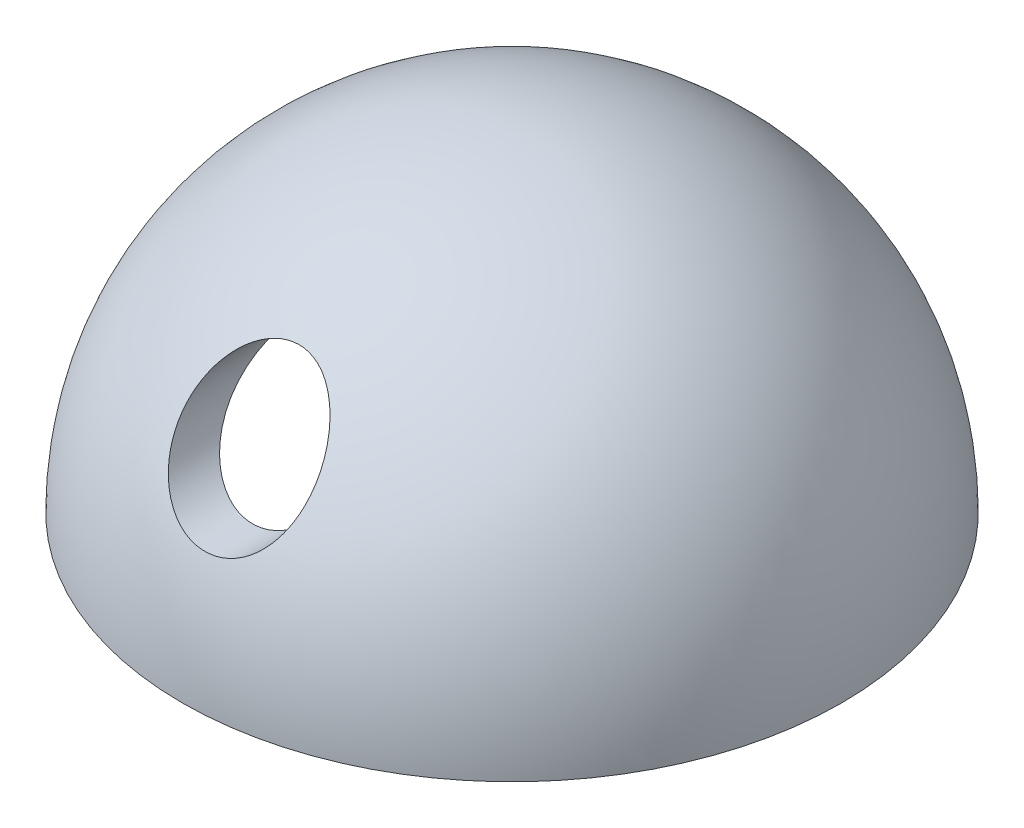
ISO-10303-21;
HEADER;
FILE_DESCRIPTION(('STEP AP214'),'2;1');
FILE_NAME('part.step','',(''),(''),'','','');
FILE_SCHEMA(('AUTOMOTIVE_DESIGN { 1 0 10303 214 1 1 1 1 }'));
ENDSEC;
DATA;
#1=APPLICATION_CONTEXT('core data for automotive mechanical design processes');
#2=APPLICATION_PROTOCOL_DEFINITION('international standard','automotive_design',2000,#1);
#3=PRODUCT_CONTEXT('',#1,'mechanical');
#4=PRODUCT('Part','Part','',(#3));
#5=PRODUCT_RELATED_PRODUCT_CATEGORY('part','',(#4));
#6=PRODUCT_DEFINITION_FORMATION('','',#4);
#7=PRODUCT_DEFINITION_CONTEXT('part definition',#1,'design');
#8=PRODUCT_DEFINITION('design','',#6,#7);
#9=PRODUCT_DEFINITION_SHAPE('','',#8);
#10=(LENGTH_UNIT() NAMED_UNIT(*) SI_UNIT(.MILLI.,.METRE.));
#11=(NAMED_UNIT(*) PLANE_ANGLE_UNIT() SI_UNIT($,.RADIAN.));
#12=(NAMED_UNIT(*) SI_UNIT($,.STERADIAN.) SOLID_ANGLE_UNIT());
#13=UNCERTAINTY_MEASURE_WITH_UNIT(LENGTH_MEASURE(1.E-05),#10,'distance_accuracy_value','');
#14=(GEOMETRIC_REPRESENTATION_CONTEXT(3) GLOBAL_UNCERTAINTY_ASSIGNED_CONTEXT((#13)) GLOBAL_UNIT_ASSIGNED_CONTEXT((#10,
#11,#12)) REPRESENTATION_CONTEXT('',''));
#15=CARTESIAN_POINT('',(0.,0.,0.));
#16=DIRECTION('',(0.,0.,1.));
#17=DIRECTION('',(1.,0.,0.));
#18=AXIS2_PLACEMENT_3D('',#15,#16,#17);
#19=CARTESIAN_POINT('',(0.,0.,0.));
#20=DIRECTION('',(0.,-1.,0.));
#21=DIRECTION('',(-1.,0.,0.));
#22=AXIS2_PLACEMENT_3D('',#19,#20,#21);
#23=SPHERICAL_SURFACE('',#22,15.);
#24=CARTESIAN_POINT('',(0.,0.,0.));
#25=DIRECTION('',(0.,-1.,0.));
#26=DIRECTION('',(0.,0.,-1.));
#27=AXIS2_PLACEMENT_3D('',#24,#25,#26);
#28=CIRCLE('',#27,15.);
#29=CARTESIAN_POINT('',(0.,0.,-15.));
#30=VERTEX_POINT('',#29);
#31=EDGE_CURVE('E10',#30,#30,#28,.T.);
#32=ORIENTED_EDGE('',*,*,#31,.F.);
#33=EDGE_LOOP('',(#32));
#34=FACE_BOUND('',#33,.T.);
#35=CARTESIAN_POINT('',(-0.956275919235735,11.2999640560477,9.81816422241555));
#36=CARTESIAN_POINT('',(-1.11476558767477,11.2466592549412,9.86407505688264));
#37=CARTESIAN_POINT('',(-1.26609255268762,11.1809563398559,9.92034488931293));
#38=CARTESIAN_POINT('',(-1.55099003334324,11.0295072111427,10.0486148956576));
#39=CARTESIAN_POINT('',(-1.68452795540196,10.9437249791378,10.1206433220669));
#40=CARTESIAN_POINT('',(-1.93126549166836,10.7573020677177,10.2752255159745));
#41=CARTESIAN_POINT('',(-2.04464500640715,10.6568091178933,10.3576736342993));
#42=CARTESIAN_POINT('',(-2.25231914724325,10.4437160516354,10.5302160776137));
#43=CARTESIAN_POINT('',(-2.34661966833009,10.3311196914056,10.6203080285781));
#44=CARTESIAN_POINT('',(-2.53331552693406,10.0727917800782,10.8242205105041));
#45=CARTESIAN_POINT('',(-2.62154055786051,9.92494224271082,10.9391777101384));
#46=CARTESIAN_POINT('',(-2.7708133708411,9.61903841807577,11.1731568377557));
#47=CARTESIAN_POINT('',(-2.83183832736055,9.46097568704616,11.2921820897007));
#48=CARTESIAN_POINT('',(-2.93471011201541,9.10957894276964,11.5525700622001));
#49=CARTESIAN_POINT('',(-2.97135178081451,8.91490331284418,11.6942061559406));
#50=CARTESIAN_POINT('',(-3.00583237025388,8.52076127721487,11.9758354579768));
#51=CARTESIAN_POINT('',(-3.00364130955635,8.32129128861907,12.1158273133711));
#52=CARTESIAN_POINT('',(-2.95804608636789,7.91460055039226,12.3965003357493));
#53=CARTESIAN_POINT('',(-2.91288430516417,7.70741294583717,12.5369551921208));
#54=CARTESIAN_POINT('',(-2.77702627922203,7.30157791929765,12.8077703205084));
#55=CARTESIAN_POINT('',(-2.68640083058343,7.10291773892055,12.9381459247757));
#56=CARTESIAN_POINT('',(-2.4881711943729,6.77239806061702,13.1521503517752));
#57=CARTESIAN_POINT('',(-2.39091478735741,6.63649127386654,13.2391823895204));
#58=CARTESIAN_POINT('',(-2.17105430185735,6.37918664772794,13.4025248835532));
#59=CARTESIAN_POINT('',(-2.04846092233905,6.25778271829763,13.4788398425385));
#60=CARTESIAN_POINT('',(-1.8464290697152,6.09034724807984,13.5833494428724));
#61=CARTESIAN_POINT('',(-1.77571068006524,6.03677821130572,13.6166493650355));
#62=CARTESIAN_POINT('',(-1.6286536675154,5.93545595030771,13.6794293385221));
#63=CARTESIAN_POINT('',(-1.55231802493272,5.887699677228,13.7089113928807));
#64=CARTESIAN_POINT('',(-1.39453504397521,5.7987363834052,13.7636798425352));
#65=CARTESIAN_POINT('',(-1.31308960652407,5.75752694705306,13.788967785499));
#66=CARTESIAN_POINT('',(-1.14570521699549,5.68233092574143,13.8350069442678));
#67=CARTESIAN_POINT('',(-1.05976709550194,5.64834301154756,13.8557589949951));
#68=CARTESIAN_POINT('',(-0.896025186378333,5.5922656523532,13.8899389579621));
#69=CARTESIAN_POINT('',(-0.818684865446617,5.56919018296558,13.9039768921644));
#70=CARTESIAN_POINT('',(-0.661837583514512,5.52925311111602,13.9282456157664));
#71=CARTESIAN_POINT('',(-0.582330923953222,5.51239064882824,13.9384769319705));
#72=CARTESIAN_POINT('',(-0.421851977693493,5.48515072539676,13.9549936378291));
#73=CARTESIAN_POINT('',(-0.340880585755394,5.47476943417213,13.9612813579818));
#74=CARTESIAN_POINT('',(-0.178176497713951,5.46063701574124,13.9698386610944));
#75=CARTESIAN_POINT('',(-0.0964438543195579,5.4568854328755,13.9721085202017));
#76=CARTESIAN_POINT('',(0.132296289672571,5.45578537345269,13.9727753385354));
#77=CARTESIAN_POINT('',(0.27944783222066,5.46591610431223,13.9666480612442));
#78=CARTESIAN_POINT('',(0.569489099127397,5.5073579454384,13.9415328685693));
#79=CARTESIAN_POINT('',(0.712379397555243,5.538666189117,13.9225466937655));
#80=CARTESIAN_POINT('',(0.989094954582825,5.62055313176705,13.8727192805131));
#81=CARTESIAN_POINT('',(1.12298112561983,5.67098278853942,13.841969715876));
#82=CARTESIAN_POINT('',(1.37987237745676,5.78888255495996,13.7697526261723));
#83=CARTESIAN_POINT('',(1.50287496572629,5.85635655449116,13.7282826544292));
#84=CARTESIAN_POINT('',(1.74456194880436,6.01133452764101,13.6324954676347));
#85=CARTESIAN_POINT('',(1.862235796979,6.09995893545084,13.5774494975911));
#86=CARTESIAN_POINT('',(2.08087526114336,6.290578709718,13.4582020033928));
#87=CARTESIAN_POINT('',(2.1818336927277,6.39257979198571,13.3939965643905));
#88=CARTESIAN_POINT('',(2.37828833077553,6.62089333812912,13.2491117665509));
#89=CARTESIAN_POINT('',(2.47133463373876,6.74864001569676,13.167376173626));
#90=CARTESIAN_POINT('',(2.63464668731569,7.01324817887956,12.9963274655716));
#91=CARTESIAN_POINT('',(2.70489987861133,7.15011463972829,12.9070102069187));
#92=CARTESIAN_POINT('',(2.83211597368676,7.45151696303362,12.7081137915435));
#93=CARTESIAN_POINT('',(2.88525591867241,7.61702125761327,12.59755613695));
#94=CARTESIAN_POINT('',(2.96211997511443,7.95119985361816,12.3711980700032));
#95=CARTESIAN_POINT('',(2.98582968073286,8.11987566649832,12.2553951188466));
#96=CARTESIAN_POINT('',(3.00610044462577,8.48100770235591,12.0037950936009));
#97=CARTESIAN_POINT('',(2.9982554754711,8.67338700645641,11.8675221149556));
#98=CARTESIAN_POINT('',(2.94637738798544,9.05275384929087,11.594047965903));
#99=CARTESIAN_POINT('',(2.90230668616077,9.23973557950788,11.4568459783482));
#100=CARTESIAN_POINT('',(2.77382673048461,9.61784599791951,11.1744036957196));
#101=CARTESIAN_POINT('',(2.68654220082881,9.80816279726882,11.0293699505727));
#102=CARTESIAN_POINT('',(2.47085566678482,10.1708951657599,10.7476475345466));
#103=CARTESIAN_POINT('',(2.34250472258061,10.3433326146247,10.6109487503119));
#104=CARTESIAN_POINT('',(2.08804094733988,10.6160960180053,10.3909078147121));
#105=CARTESIAN_POINT('',(1.9721472054255,10.7228036594265,10.3036152131022));
#106=CARTESIAN_POINT('',(1.71988731420436,10.919684114162,10.1407386392983));
#107=CARTESIAN_POINT('',(1.58355427336655,11.0098831534804,10.065136126099));
#108=CARTESIAN_POINT('',(1.31971151250131,11.1539400758316,9.9432909766887));
#109=CARTESIAN_POINT('',(1.1955235951083,11.2114499707799,9.89419833383612));
#110=CARTESIAN_POINT('',(0.936339858054303,11.3099524649202,9.80964876738331));
#111=CARTESIAN_POINT('',(0.801350634776325,11.3509550542566,9.77418359709406));
#112=CARTESIAN_POINT('',(0.522719494679511,11.4140374250548,9.71945528055783));
#113=CARTESIAN_POINT('',(0.379023629203209,11.4359827542402,9.70030727213588));
#114=CARTESIAN_POINT('',(0.0887292546471352,11.4586693293078,9.68051090559436));
#115=CARTESIAN_POINT('',(-0.0578674378417332,11.4594234499691,9.67985131478474));
#116=CARTESIAN_POINT('',(-0.33298410587496,11.4407644483244,9.69613550345196));
#117=CARTESIAN_POINT('',(-0.461770625677835,11.4234843077906,9.7112174834324));
#118=CARTESIAN_POINT('',(-0.71381602899004,11.3731342681885,9.75496287016653));
#119=CARTESIAN_POINT('',(-0.837071914905933,11.3400559169524,9.78363354691789));
#120=CARTESIAN_POINT('',(-0.956275919235735,11.2999640560477,9.81816422241555));
#121=B_SPLINE_CURVE_WITH_KNOTS('',3,(#35,#36,#37,#38,#39,#40,#41,#42,#43,#44,#45,#46,#47,#48,
#49,#50,#51,#52,#53,#54,#55,#56,#57,#58,#59,#60,#61,#62,#63,#64,#65,#66,#67,#68,#69,#70,#71,#72,
#73,#74,#75,#76,#77,#78,#79,#80,#81,#82,#83,#84,#85,#86,#87,#88,#89,#90,#91,#92,#93,#94,#95,#96,
#97,#98,#99,#100,#101,#102,#103,#104,#105,#106,#107,#108,#109,#110,#111,#112,#113,#114,#115,
#116,#117,#118,#119,#120),.UNSPECIFIED.,.T.,.F.,(4,2,2,2,2,2,2,2,2,2,2,2,2,2,2,2,2,2,2,2,2,2,2,
2,2,2,2,2,2,2,2,2,2,2,2,2,2,2,2,2,2,2,4),(0.,0.519579926661069,1.04009911917161,
1.55571024991983,2.07116182404759,2.68992785841392,3.3092121706373,4.03656696179945,
4.7644833415828,5.5235139399636,6.28136622653575,6.84446807025052,7.40733261870921,
7.69126773398478,7.97505327460071,8.25873386146558,8.54236218714925,8.78778780853692,
9.0331794523972,9.27842594321175,9.52365557759306,9.9641924522884,10.4046697078443,
10.8417819743108,11.2789940894032,11.7488969938662,12.2190013445781,12.7507159399611,
13.2827230217717,13.8983261224439,14.5142304366291,15.2189151949764,15.9243319741984,
16.684707921586,17.4441421009171,17.982565279519,18.5201255362957,18.9545965842089,
19.3888042955681,19.8260510933156,20.263032234781,20.6536119663069,21.0444008955626),.UNSPECIFIED.);
#122=CARTESIAN_POINT('',(-0.956275919235735,11.2999640560477,9.81816422241555));
#123=VERTEX_POINT('',#122);
#124=EDGE_CURVE('E49',#123,#123,#121,.T.);
#125=ORIENTED_EDGE('',*,*,#124,.F.);
#126=EDGE_LOOP('',(#125));
#127=FACE_BOUND('',#126,.T.);
#128=ADVANCED_FACE('F33',(#34,#127),#23,.T.);
#129=CARTESIAN_POINT('',(0.,0.,0.));
#130=DIRECTION('',(0.,-1.,0.));
#131=DIRECTION('',(-1.,0.,0.));
#132=AXIS2_PLACEMENT_3D('',#129,#130,#131);
#133=SPHERICAL_SURFACE('',#132,13.);
#134=CARTESIAN_POINT('',(0.,0.,0.));
#135=DIRECTION('',(0.,1.,0.));
#136=DIRECTION('',(0.,0.,1.));
#137=AXIS2_PLACEMENT_3D('',#134,#135,#136);
#138=CIRCLE('',#137,13.);
#139=CARTESIAN_POINT('',(0.,0.,13.));
#140=VERTEX_POINT('',#139);
#141=EDGE_CURVE('E45',#140,#140,#138,.F.);
#142=ORIENTED_EDGE('',*,*,#141,.T.);
#143=EDGE_LOOP('',(#142));
#144=FACE_BOUND('',#143,.T.);
#145=CARTESIAN_POINT('',(-1.12093122048198,11.2391731723254,6.43618672829109));
#146=CARTESIAN_POINT('',(-1.28998510369317,11.1710773955262,6.52564896567241));
#147=CARTESIAN_POINT('',(-1.44639149000131,11.0901903332503,6.62998506057053));
#148=CARTESIAN_POINT('',(-1.66221532397639,10.95532180136,6.79915873469849));
#149=CARTESIAN_POINT('',(-1.73125228734331,10.9079024841786,6.8579098507244));
#150=CARTESIAN_POINT('',(-1.86334519257582,10.8090572577313,6.97872733300894));
#151=CARTESIAN_POINT('',(-1.92640270880124,10.7576324096341,7.04079281984447));
#152=CARTESIAN_POINT('',(-2.06867904746917,10.6319067098526,7.19045213111262));
#153=CARTESIAN_POINT('',(-2.14542584541376,10.556092516528,7.27911492673779));
#154=CARTESIAN_POINT('',(-2.28879143597598,10.3988142793422,7.45959594954476));
#155=CARTESIAN_POINT('',(-2.35540579247765,10.3173477834274,7.55141553736616));
#156=CARTESIAN_POINT('',(-2.47873002291466,10.1495950532163,7.73699124321679));
#157=CARTESIAN_POINT('',(-2.53545280594085,10.0633152976916,7.83074465595725));
#158=CARTESIAN_POINT('',(-2.63924018409932,9.88646286468844,8.0194573531136));
#159=CARTESIAN_POINT('',(-2.68630605514839,9.79589075628495,8.11441647646253));
#160=CARTESIAN_POINT('',(-2.81529412268277,9.51365770385058,8.40512009513222));
#161=CARTESIAN_POINT('',(-2.88185844341733,9.31580242845721,8.60189365445548));
#162=CARTESIAN_POINT('',(-2.97310310642296,8.90837871463531,8.9935218553671));
#163=CARTESIAN_POINT('',(-2.99774178626812,8.69879883851443,9.18837439711196));
#164=CARTESIAN_POINT('',(-3.00101596175127,8.36901943339907,9.48569445018907));
#165=CARTESIAN_POINT('',(-2.99532225458637,8.25086758694614,9.59042058298166));
#166=CARTESIAN_POINT('',(-2.96955028241851,8.01374290719293,9.79727502749401));
#167=CARTESIAN_POINT('',(-2.94946866253259,7.89476988882587,9.89940272757532));
#168=CARTESIAN_POINT('',(-2.89424008269995,7.65760304661923,10.0999663694586));
#169=CARTESIAN_POINT('',(-2.8591242690576,7.53940812200786,10.1984094886123));
#170=CARTESIAN_POINT('',(-2.773099800515,7.30515923554537,10.3908321680696));
#171=CARTESIAN_POINT('',(-2.72219376053013,7.18910492257062,10.4848124644627));
#172=CARTESIAN_POINT('',(-2.58776609490487,6.92996746908229,10.6920130614309));
#173=CARTESIAN_POINT('',(-2.49914118689026,6.78810460932538,10.8035260057681));
#174=CARTESIAN_POINT('',(-2.29421756799966,6.51596993975676,11.0144783136157));
#175=CARTESIAN_POINT('',(-2.17796143717294,6.38568071508194,11.1139359019596));
#176=CARTESIAN_POINT('',(-1.93996677053235,6.16333838243823,11.2817315173929));
#177=CARTESIAN_POINT('',(-1.82249767798173,6.06854750894486,11.3524868624952));
#178=CARTESIAN_POINT('',(-1.56948623679105,5.89517877581352,11.480903129776));
#179=CARTESIAN_POINT('',(-1.43394753266784,5.8165976548995,11.5385666861559));
#180=CARTESIAN_POINT('',(-1.21872349639193,5.71398768507819,11.6134452212238));
#181=CARTESIAN_POINT('',(-1.14465089399463,5.68222458685797,11.6365426478305));
#182=CARTESIAN_POINT('',(-0.993140603355439,5.62445509284885,11.6784491418062));
#183=CARTESIAN_POINT('',(-0.915704664691939,5.59844574591677,11.6972604077291));
#184=CARTESIAN_POINT('',(-0.758090057494709,5.55266060418188,11.7303139096878));
#185=CARTESIAN_POINT('',(-0.677912499062821,5.53288231874602,11.7445579713326));
#186=CARTESIAN_POINT('',(-0.515550912524674,5.49992440526532,11.7682645065448));
#187=CARTESIAN_POINT('',(-0.433367194626175,5.48674376373607,11.7777277145159));
#188=CARTESIAN_POINT('',(-0.206551758496531,5.46007878761656,11.796863563663));
#189=CARTESIAN_POINT('',(-0.0605799543582119,5.45354442104983,11.8015400376485));
#190=CARTESIAN_POINT('',(0.230331445127066,5.46176995601544,11.7956440415049));
#191=CARTESIAN_POINT('',(0.375271381271259,5.47652246471569,11.7850768654243));
#192=CARTESIAN_POINT('',(0.651974705316622,5.52497525826023,11.7502556284784));
#193=CARTESIAN_POINT('',(0.78402639034975,5.557604504578,11.7267749673803));
#194=CARTESIAN_POINT('',(1.04004549769999,5.63929884226856,11.6677140681918));
#195=CARTESIAN_POINT('',(1.16401184213858,5.68836611971077,11.6321322207729));
#196=CARTESIAN_POINT('',(1.40839485844505,5.80395768494886,11.5478005076074));
#197=CARTESIAN_POINT('',(1.52818195337478,5.8713337778557,11.4984032429251));
#198=CARTESIAN_POINT('',(1.7542182436785,6.0190447014716,11.3892516959298));
#199=CARTESIAN_POINT('',(1.86046234943572,6.0993843785,11.3294935396658));
#200=CARTESIAN_POINT('',(2.07253896828703,6.28232064298942,11.1921693949244));
#201=CARTESIAN_POINT('',(2.17617998914924,6.3864579046979,11.1132799167607));
#202=CARTESIAN_POINT('',(2.36430710606077,6.6042133682833,10.9463310708063));
#203=CARTESIAN_POINT('',(2.4487772052313,6.71783938055199,10.8582641337771));
#204=CARTESIAN_POINT('',(2.63359124618968,7.00546004652986,10.6323484558167));
#205=CARTESIAN_POINT('',(2.7232267509227,7.18308323724859,10.4903042422812));
#206=CARTESIAN_POINT('',(2.86449057800595,7.54409942138848,10.1951376556136));
#207=CARTESIAN_POINT('',(2.91606367272688,7.72750039778722,10.0419995376565));
#208=CARTESIAN_POINT('',(2.98432454232733,8.09664036759682,9.72620717213648));
#209=CARTESIAN_POINT('',(3.00055462528051,8.28237906176881,9.56345579030441));
#210=CARTESIAN_POINT('',(2.99941590967766,8.64933738318396,9.23328147749597));
#211=CARTESIAN_POINT('',(2.98204454902168,8.83055666475606,9.06585819124766));
#212=CARTESIAN_POINT('',(2.90895293077114,9.22143823235712,8.69432510734585));
#213=CARTESIAN_POINT('',(2.84612372338404,9.42934859064073,8.48970756497312));
#214=CARTESIAN_POINT('',(2.71908706217147,9.728589778595,8.18433466296069));
#215=CARTESIAN_POINT('',(2.67122758915289,9.82630162415512,8.08272663848989));
#216=CARTESIAN_POINT('',(2.56455432961104,10.0168989629569,7.88079359257637));
#217=CARTESIAN_POINT('',(2.5057435244268,10.1097857609656,7.78046822987268));
#218=CARTESIAN_POINT('',(2.34132323632746,10.3400373444167,7.5269606991489));
#219=CARTESIAN_POINT('',(2.22782091525959,10.4735865906623,7.37523534787976));
#220=CARTESIAN_POINT('',(2.03639867177021,10.6612309152947,7.15573875010464));
#221=CARTESIAN_POINT('',(1.96910133019072,10.7216392330357,7.08395502631037));
#222=CARTESIAN_POINT('',(1.8270516121394,10.837693797362,6.94403065044593));
#223=CARTESIAN_POINT('',(1.7523026944961,10.8933422312794,6.87588833048509));
#224=CARTESIAN_POINT('',(1.5730240257891,11.0138576407871,6.72623736672415));
#225=CARTESIAN_POINT('',(1.46599166404635,11.0769874384463,6.64627829169583));
#226=CARTESIAN_POINT('',(1.23832564839741,11.1919188119964,6.49839677116715));
#227=CARTESIAN_POINT('',(1.11771217857639,11.2437368710454,6.4304568394621));
#228=CARTESIAN_POINT('',(0.892252910777185,11.3225822622361,6.32581281134518));
#229=CARTESIAN_POINT('',(0.79013820327395,11.3525697202785,6.28551850816153));
#230=CARTESIAN_POINT('',(0.579079520317341,11.4020243915076,6.21862839193114));
#231=CARTESIAN_POINT('',(0.470144321823445,11.4215048272806,6.19201536363968));
#232=CARTESIAN_POINT('',(0.247018660261246,11.4483933911193,6.15518810786492));
#233=CARTESIAN_POINT('',(0.13279174063276,11.4556987415854,6.14511350224818));
#234=CARTESIAN_POINT('',(-0.0959244074816622,11.4571005879199,6.14318449564104));
#235=CARTESIAN_POINT('',(-0.2104136458936,11.4511965754229,6.1513307958864));
#236=CARTESIAN_POINT('',(-0.421569526003068,11.4283546242814,6.18264357041721));
#237=CARTESIAN_POINT('',(-0.518703187714074,11.4128547305522,6.20385083856007));
#238=CARTESIAN_POINT('',(-0.707924970289115,11.3733349216847,6.25748715184895));
#239=CARTESIAN_POINT('',(-0.800014736205816,11.349317803749,6.2899125126956));
#240=CARTESIAN_POINT('',(-0.928934464991331,11.3093203326224,6.34337283574146));
#241=CARTESIAN_POINT('',(-0.968229206123865,11.2962132389296,6.36082646504344));
#242=CARTESIAN_POINT('',(-1.04553178495008,11.2686695172591,6.39734083534755));
#243=CARTESIAN_POINT('',(-1.08354084825761,11.2542342072633,6.41639998165047));
#244=CARTESIAN_POINT('',(-1.12093122048198,11.2391731723254,6.43618672829109));
#245=B_SPLINE_CURVE_WITH_KNOTS('',3,(#145,#146,#147,#148,#149,#150,#151,#152,#153,#154,#155,
#156,#157,#158,#159,#160,#161,#162,#163,#164,#165,#166,#167,#168,#169,#170,#171,#172,#173,#174,
#175,#176,#177,#178,#179,#180,#181,#182,#183,#184,#185,#186,#187,#188,#189,#190,#191,#192,#193,
#194,#195,#196,#197,#198,#199,#200,#201,#202,#203,#204,#205,#206,#207,#208,#209,#210,#211,#212,
#213,#214,#215,#216,#217,#218,#219,#220,#221,#222,#223,#224,#225,#226,#227,#228,#229,#230,#231,
#232,#233,#234,#235,#236,#237,#238,#239,#240,#241,#242,#243,#244),.UNSPECIFIED.,.T.,.F.,(4,2,2,
2,2,2,2,2,2,2,2,2,2,2,2,2,2,2,2,2,2,2,2,2,2,2,2,2,2,2,2,2,2,2,2,2,2,2,2,2,2,2,2,2,2,2,2,2,2,4),
(0.,0.608861467571289,0.915638452918901,1.22233443976291,1.64066643868976,2.05918106492946,
2.47714534927578,2.89505437459669,3.75220447428251,4.61020584641254,5.08359116598794,
5.55708690251156,6.02960640994132,6.50204770826715,7.10280908599802,7.70265061800709,
8.20081756843856,8.69888419359127,8.95009167018011,9.20117000024158,9.4521478434554,
9.70308712134883,10.1391584648969,10.5750783993552,10.9873559544081,11.3996883594225,
11.8360891139576,12.2726533925849,12.7710774826307,13.269915958208,13.9993182011383,
14.7297767193506,15.4696397777671,16.2095592527425,17.1006282832995,17.5468356035855,
17.9929216276131,18.685741054466,19.0318113584302,19.3777217669476,19.8197825115448,
20.2611947324949,20.6013359722885,20.941048155853,21.2836138032748,21.6261926346415,
21.9268661757944,22.2274410619078,22.3622379079846,22.4969024094627),.UNSPECIFIED.);
#246=CARTESIAN_POINT('',(-1.12093122048198,11.2391731723254,6.43618672829109));
#247=VERTEX_POINT('',#246);
#248=EDGE_CURVE('E37',#247,#247,#245,.T.);
#249=ORIENTED_EDGE('',*,*,#248,.T.);
#250=EDGE_LOOP('',(#249));
#251=FACE_BOUND('',#250,.T.);
#252=ADVANCED_FACE('F60',(#144,#251),#133,.F.);
#253=CARTESIAN_POINT('',(0.,0.,0.));
#254=DIRECTION('',(0.,1.,0.));
#255=DIRECTION('',(0.,0.,1.));
#256=AXIS2_PLACEMENT_3D('',#253,#254,#255);
#257=PLANE('',#256);
#258=ORIENTED_EDGE('',*,*,#141,.F.);
#259=EDGE_LOOP('',(#258));
#260=FACE_BOUND('',#259,.T.);
#261=ORIENTED_EDGE('',*,*,#31,.T.);
#262=EDGE_LOOP('',(#261));
#263=FACE_BOUND('',#262,.T.);
#264=ADVANCED_FACE('F35',(#260,#263),#257,.F.);
#265=CARTESIAN_POINT('',(0.,8.45645629866597,15.));
#266=DIRECTION('',(0.,0.,-1.));
#267=DIRECTION('',(-1.,0.,0.));
#268=AXIS2_PLACEMENT_3D('',#265,#266,#267);
#269=CYLINDRICAL_SURFACE('',#268,3.);
#270=ORIENTED_EDGE('',*,*,#248,.F.);
#271=EDGE_LOOP('',(#270));
#272=FACE_BOUND('',#271,.T.);
#273=ORIENTED_EDGE('',*,*,#124,.T.);
#274=EDGE_LOOP('',(#273));
#275=FACE_BOUND('',#274,.T.);
#276=ADVANCED_FACE('F56',(#272,#275),#269,.F.);
#277=CLOSED_SHELL('',(#128,#252,#264,#276));
#278=MANIFOLD_SOLID_BREP('B2',#277);
#279=ADVANCED_BREP_SHAPE_REPRESENTATION('',(#18,#278),#14);
#280=SHAPE_DEFINITION_REPRESENTATION(#9,#279);
ENDSEC;
END-ISO-10303-21;
